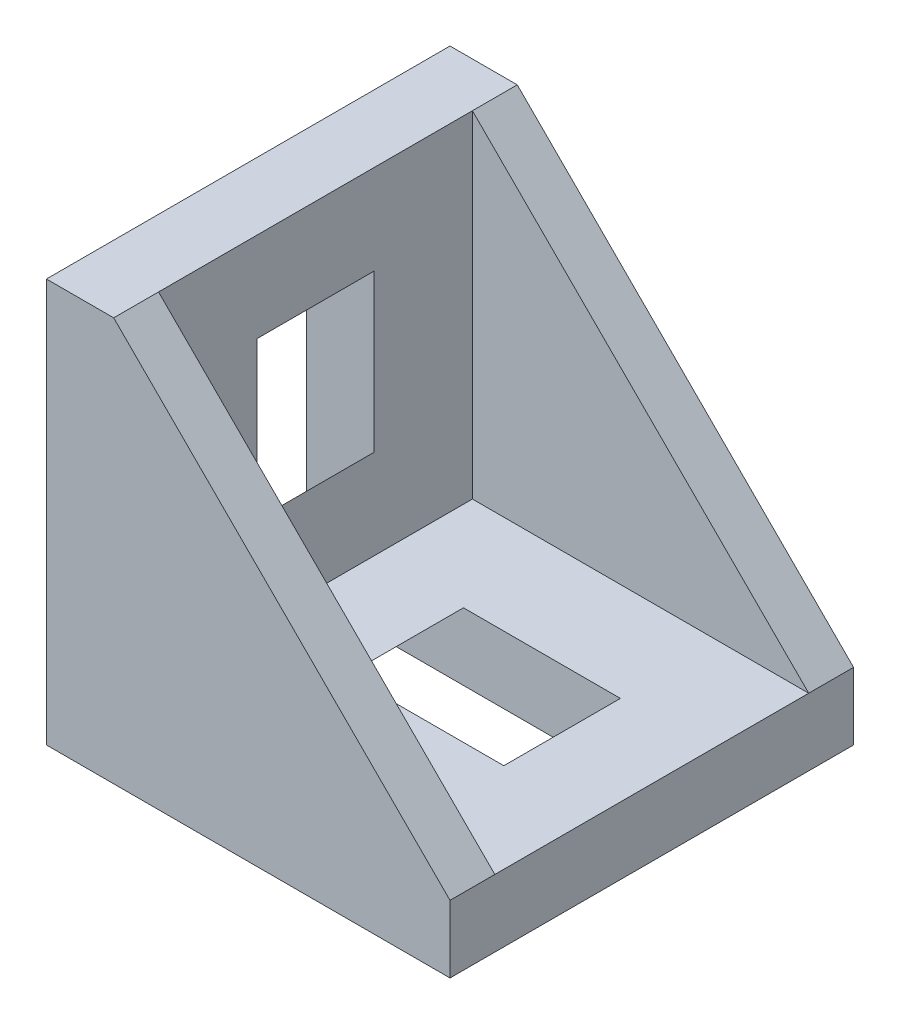
ISO-10303-21;
HEADER;
FILE_DESCRIPTION(('STEP AP214'),'2;1');
FILE_NAME('part.step','',(''),(''),'','','');
FILE_SCHEMA(('AUTOMOTIVE_DESIGN { 1 0 10303 214 1 1 1 1 }'));
ENDSEC;
DATA;
#1=APPLICATION_CONTEXT('core data for automotive mechanical design processes');
#2=APPLICATION_PROTOCOL_DEFINITION('international standard','automotive_design',2000,#1);
#3=PRODUCT_CONTEXT('',#1,'mechanical');
#4=PRODUCT('Part','Part','',(#3));
#5=PRODUCT_RELATED_PRODUCT_CATEGORY('part','',(#4));
#6=PRODUCT_DEFINITION_FORMATION('','',#4);
#7=PRODUCT_DEFINITION_CONTEXT('part definition',#1,'design');
#8=PRODUCT_DEFINITION('design','',#6,#7);
#9=PRODUCT_DEFINITION_SHAPE('','',#8);
#10=(LENGTH_UNIT() NAMED_UNIT(*) SI_UNIT(.MILLI.,.METRE.));
#11=(NAMED_UNIT(*) PLANE_ANGLE_UNIT() SI_UNIT($,.RADIAN.));
#12=(NAMED_UNIT(*) SI_UNIT($,.STERADIAN.) SOLID_ANGLE_UNIT());
#13=UNCERTAINTY_MEASURE_WITH_UNIT(LENGTH_MEASURE(1.E-05),#10,'distance_accuracy_value','');
#14=(GEOMETRIC_REPRESENTATION_CONTEXT(3) GLOBAL_UNCERTAINTY_ASSIGNED_CONTEXT((#13)) GLOBAL_UNIT_ASSIGNED_CONTEXT((#10,
#11,#12)) REPRESENTATION_CONTEXT('',''));
#15=CARTESIAN_POINT('',(0.,0.,0.));
#16=DIRECTION('',(0.,0.,1.));
#17=DIRECTION('',(1.,0.,0.));
#18=AXIS2_PLACEMENT_3D('',#15,#16,#17);
#19=CARTESIAN_POINT('',(0.,0.,9.));
#20=DIRECTION('',(1.,0.,0.));
#21=DIRECTION('',(0.,0.,-1.));
#22=AXIS2_PLACEMENT_3D('',#19,#20,#21);
#23=PLANE('',#22);
#24=DIRECTION('',(0.,0.,-1.));
#25=VECTOR('',#24,1.);
#26=CARTESIAN_POINT('',(0.,17.3,3.));
#27=LINE('',#26,#25);
#28=CARTESIAN_POINT('',(0.,17.3,3.));
#29=VERTEX_POINT('',#28);
#30=CARTESIAN_POINT('',(0.,17.3,-3.));
#31=VERTEX_POINT('',#30);
#32=EDGE_CURVE('E288',#29,#31,#27,.T.);
#33=ORIENTED_EDGE('',*,*,#32,.F.);
#34=DIRECTION('',(0.,1.,0.));
#35=VECTOR('',#34,1.);
#36=CARTESIAN_POINT('',(0.,17.3,3.));
#37=LINE('',#36,#35);
#38=CARTESIAN_POINT('',(0.,14.9992165715514,3.));
#39=VERTEX_POINT('',#38);
#40=EDGE_CURVE('E285',#39,#29,#37,.T.);
#41=ORIENTED_EDGE('',*,*,#40,.F.);
#42=DIRECTION('',(0.,0.,-1.));
#43=VECTOR('',#42,1.);
#44=CARTESIAN_POINT('',(0.,14.9992165715514,3.));
#45=LINE('',#44,#43);
#46=CARTESIAN_POINT('',(0.,14.9992165715514,-3.));
#47=VERTEX_POINT('',#46);
#48=EDGE_CURVE('E299',#39,#47,#45,.T.);
#49=ORIENTED_EDGE('',*,*,#48,.T.);
#50=DIRECTION('',(0.,1.,0.));
#51=VECTOR('',#50,1.);
#52=CARTESIAN_POINT('',(0.,17.3,-3.));
#53=LINE('',#52,#51);
#54=EDGE_CURVE('E280',#47,#31,#53,.T.);
#55=ORIENTED_EDGE('',*,*,#54,.T.);
#56=EDGE_LOOP('',(#33,#41,#49,#55));
#57=FACE_BOUND('',#56,.T.);
#58=DIRECTION('',(0.,-1.,0.));
#59=VECTOR('',#58,1.);
#60=CARTESIAN_POINT('',(0.,14.,-2.6));
#61=LINE('',#60,#59);
#62=CARTESIAN_POINT('',(0.,14.,-2.6));
#63=VERTEX_POINT('',#62);
#64=CARTESIAN_POINT('',(0.,4.,-2.6));
#65=VERTEX_POINT('',#64);
#66=EDGE_CURVE('E402',#63,#65,#61,.T.);
#67=ORIENTED_EDGE('',*,*,#66,.F.);
#68=DIRECTION('',(0.,0.,1.));
#69=VECTOR('',#68,1.);
#70=CARTESIAN_POINT('',(0.,14.,-2.6));
#71=LINE('',#70,#69);
#72=CARTESIAN_POINT('',(0.,14.,2.6));
#73=VERTEX_POINT('',#72);
#74=EDGE_CURVE('E425',#63,#73,#71,.T.);
#75=ORIENTED_EDGE('',*,*,#74,.T.);
#76=DIRECTION('',(0.,-1.,0.));
#77=VECTOR('',#76,1.);
#78=CARTESIAN_POINT('',(0.,14.,2.6));
#79=LINE('',#78,#77);
#80=CARTESIAN_POINT('',(0.,4.,2.6));
#81=VERTEX_POINT('',#80);
#82=EDGE_CURVE('E393',#73,#81,#79,.T.);
#83=ORIENTED_EDGE('',*,*,#82,.T.);
#84=DIRECTION('',(0.,0.,1.));
#85=VECTOR('',#84,1.);
#86=CARTESIAN_POINT('',(0.,4.,-2.6));
#87=LINE('',#86,#85);
#88=EDGE_CURVE('E414',#65,#81,#87,.T.);
#89=ORIENTED_EDGE('',*,*,#88,.F.);
#90=EDGE_LOOP('',(#67,#75,#83,#89));
#91=FACE_BOUND('',#90,.T.);
#92=DIRECTION('',(0.,-1.,0.));
#93=VECTOR('',#92,1.);
#94=CARTESIAN_POINT('',(0.,0.,-9.));
#95=LINE('',#94,#93);
#96=CARTESIAN_POINT('',(0.,18.,-9.));
#97=VERTEX_POINT('',#96);
#98=CARTESIAN_POINT('',(0.,0.,-9.));
#99=VERTEX_POINT('',#98);
#100=EDGE_CURVE('E465',#97,#99,#95,.T.);
#101=ORIENTED_EDGE('',*,*,#100,.T.);
#102=DIRECTION('',(0.,0.,-1.));
#103=VECTOR('',#102,1.);
#104=CARTESIAN_POINT('',(0.,0.,9.));
#105=LINE('',#104,#103);
#106=CARTESIAN_POINT('',(0.,0.,9.));
#107=VERTEX_POINT('',#106);
#108=EDGE_CURVE('E473',#107,#99,#105,.T.);
#109=ORIENTED_EDGE('',*,*,#108,.F.);
#110=DIRECTION('',(0.,-1.,0.));
#111=VECTOR('',#110,1.);
#112=CARTESIAN_POINT('',(0.,0.,9.));
#113=LINE('',#112,#111);
#114=CARTESIAN_POINT('',(0.,18.,9.));
#115=VERTEX_POINT('',#114);
#116=EDGE_CURVE('E471',#115,#107,#113,.T.);
#117=ORIENTED_EDGE('',*,*,#116,.F.);
#118=DIRECTION('',(0.,0.,-1.));
#119=VECTOR('',#118,1.);
#120=CARTESIAN_POINT('',(0.,18.,9.));
#121=LINE('',#120,#119);
#122=EDGE_CURVE('E487',#115,#97,#121,.T.);
#123=ORIENTED_EDGE('',*,*,#122,.T.);
#124=EDGE_LOOP('',(#101,#109,#117,#123));
#125=FACE_BOUND('',#124,.T.);
#126=DIRECTION('',(0.,1.,0.));
#127=VECTOR('',#126,1.);
#128=CARTESIAN_POINT('',(0.,1.23475047748415,3.));
#129=LINE('',#128,#127);
#130=CARTESIAN_POINT('',(0.,1.23475047748415,3.));
#131=VERTEX_POINT('',#130);
#132=CARTESIAN_POINT('',(0.,3.53553390593273,3.));
#133=VERTEX_POINT('',#132);
#134=EDGE_CURVE('E308',#131,#133,#129,.T.);
#135=ORIENTED_EDGE('',*,*,#134,.F.);
#136=DIRECTION('',(0.,0.,-1.));
#137=VECTOR('',#136,1.);
#138=CARTESIAN_POINT('',(0.,1.23475047748415,3.));
#139=LINE('',#138,#137);
#140=CARTESIAN_POINT('',(0.,1.23475047748415,-3.));
#141=VERTEX_POINT('',#140);
#142=EDGE_CURVE('E318',#131,#141,#139,.T.);
#143=ORIENTED_EDGE('',*,*,#142,.T.);
#144=DIRECTION('',(0.,1.,0.));
#145=VECTOR('',#144,1.);
#146=CARTESIAN_POINT('',(0.,1.23475047748415,-3.));
#147=LINE('',#146,#145);
#148=CARTESIAN_POINT('',(0.,3.53553390593273,-3.));
#149=VERTEX_POINT('',#148);
#150=EDGE_CURVE('E307',#141,#149,#147,.T.);
#151=ORIENTED_EDGE('',*,*,#150,.T.);
#152=DIRECTION('',(0.,0.,-1.));
#153=VECTOR('',#152,1.);
#154=CARTESIAN_POINT('',(0.,3.53553390593273,3.));
#155=LINE('',#154,#153);
#156=EDGE_CURVE('E334',#133,#149,#155,.T.);
#157=ORIENTED_EDGE('',*,*,#156,.F.);
#158=EDGE_LOOP('',(#135,#143,#151,#157));
#159=FACE_BOUND('',#158,.T.);
#160=ADVANCED_FACE('F32',(#57,#91,#125,#159),#23,.F.);
#161=CARTESIAN_POINT('',(18.,0.,9.));
#162=DIRECTION('',(0.,1.,0.));
#163=DIRECTION('',(-1.,0.,0.));
#164=AXIS2_PLACEMENT_3D('',#161,#162,#163);
#165=PLANE('',#164);
#166=DIRECTION('',(0.,0.,-1.));
#167=VECTOR('',#166,1.);
#168=CARTESIAN_POINT('',(14.9992165715514,0.,3.));
#169=LINE('',#168,#167);
#170=CARTESIAN_POINT('',(14.9992165715514,0.,3.));
#171=VERTEX_POINT('',#170);
#172=CARTESIAN_POINT('',(14.9992165715514,0.,-3.));
#173=VERTEX_POINT('',#172);
#174=EDGE_CURVE('E47',#171,#173,#169,.T.);
#175=ORIENTED_EDGE('',*,*,#174,.F.);
#176=DIRECTION('',(-1.,0.,0.));
#177=VECTOR('',#176,1.);
#178=CARTESIAN_POINT('',(17.3,0.,3.));
#179=LINE('',#178,#177);
#180=CARTESIAN_POINT('',(17.3,0.,3.));
#181=VERTEX_POINT('',#180);
#182=EDGE_CURVE('E52',#181,#171,#179,.T.);
#183=ORIENTED_EDGE('',*,*,#182,.F.);
#184=DIRECTION('',(0.,0.,-1.));
#185=VECTOR('',#184,1.);
#186=CARTESIAN_POINT('',(17.3,0.,3.));
#187=LINE('',#186,#185);
#188=CARTESIAN_POINT('',(17.3,0.,-3.));
#189=VERTEX_POINT('',#188);
#190=EDGE_CURVE('E260',#181,#189,#187,.T.);
#191=ORIENTED_EDGE('',*,*,#190,.T.);
#192=DIRECTION('',(-1.,0.,0.));
#193=VECTOR('',#192,1.);
#194=CARTESIAN_POINT('',(17.3,0.,-3.));
#195=LINE('',#194,#193);
#196=EDGE_CURVE('E264',#189,#173,#195,.T.);
#197=ORIENTED_EDGE('',*,*,#196,.T.);
#198=EDGE_LOOP('',(#175,#183,#191,#197));
#199=FACE_BOUND('',#198,.T.);
#200=DIRECTION('',(1.,0.,0.));
#201=VECTOR('',#200,1.);
#202=CARTESIAN_POINT('',(4.,0.,-2.6));
#203=LINE('',#202,#201);
#204=CARTESIAN_POINT('',(4.,0.,-2.6));
#205=VERTEX_POINT('',#204);
#206=CARTESIAN_POINT('',(14.,0.,-2.6));
#207=VERTEX_POINT('',#206);
#208=EDGE_CURVE('E370',#205,#207,#203,.T.);
#209=ORIENTED_EDGE('',*,*,#208,.F.);
#210=DIRECTION('',(0.,0.,1.));
#211=VECTOR('',#210,1.);
#212=CARTESIAN_POINT('',(4.,0.,-2.6));
#213=LINE('',#212,#211);
#214=CARTESIAN_POINT('',(4.,0.,2.6));
#215=VERTEX_POINT('',#214);
#216=EDGE_CURVE('E380',#205,#215,#213,.T.);
#217=ORIENTED_EDGE('',*,*,#216,.T.);
#218=DIRECTION('',(1.,0.,0.));
#219=VECTOR('',#218,1.);
#220=CARTESIAN_POINT('',(4.,0.,2.6));
#221=LINE('',#220,#219);
#222=CARTESIAN_POINT('',(14.,0.,2.6));
#223=VERTEX_POINT('',#222);
#224=EDGE_CURVE('E383',#215,#223,#221,.T.);
#225=ORIENTED_EDGE('',*,*,#224,.T.);
#226=DIRECTION('',(0.,0.,1.));
#227=VECTOR('',#226,1.);
#228=CARTESIAN_POINT('',(14.,0.,-2.6));
#229=LINE('',#228,#227);
#230=EDGE_CURVE('E397',#207,#223,#229,.T.);
#231=ORIENTED_EDGE('',*,*,#230,.F.);
#232=EDGE_LOOP('',(#209,#217,#225,#231));
#233=FACE_BOUND('',#232,.T.);
#234=DIRECTION('',(1.,0.,0.));
#235=VECTOR('',#234,1.);
#236=CARTESIAN_POINT('',(18.,0.,-9.));
#237=LINE('',#236,#235);
#238=CARTESIAN_POINT('',(18.,0.,-9.));
#239=VERTEX_POINT('',#238);
#240=EDGE_CURVE('E457',#99,#239,#237,.T.);
#241=ORIENTED_EDGE('',*,*,#240,.T.);
#242=DIRECTION('',(0.,0.,-1.));
#243=VECTOR('',#242,1.);
#244=CARTESIAN_POINT('',(18.,0.,9.));
#245=LINE('',#244,#243);
#246=CARTESIAN_POINT('',(18.,0.,9.));
#247=VERTEX_POINT('',#246);
#248=EDGE_CURVE('E11',#247,#239,#245,.T.);
#249=ORIENTED_EDGE('',*,*,#248,.F.);
#250=DIRECTION('',(1.,0.,0.));
#251=VECTOR('',#250,1.);
#252=CARTESIAN_POINT('',(18.,0.,9.));
#253=LINE('',#252,#251);
#254=EDGE_CURVE('E461',#107,#247,#253,.T.);
#255=ORIENTED_EDGE('',*,*,#254,.F.);
#256=ORIENTED_EDGE('',*,*,#108,.T.);
#257=EDGE_LOOP('',(#241,#249,#255,#256));
#258=FACE_BOUND('',#257,.T.);
#259=DIRECTION('',(-1.,0.,0.));
#260=VECTOR('',#259,1.);
#261=CARTESIAN_POINT('',(1.23475047748409,0.,3.));
#262=LINE('',#261,#260);
#263=CARTESIAN_POINT('',(3.53553390593274,0.,3.));
#264=VERTEX_POINT('',#263);
#265=CARTESIAN_POINT('',(1.23475047748409,0.,3.));
#266=VERTEX_POINT('',#265);
#267=EDGE_CURVE('E339',#264,#266,#262,.T.);
#268=ORIENTED_EDGE('',*,*,#267,.F.);
#269=DIRECTION('',(0.,0.,-1.));
#270=VECTOR('',#269,1.);
#271=CARTESIAN_POINT('',(3.53553390593274,0.,3.));
#272=LINE('',#271,#270);
#273=CARTESIAN_POINT('',(3.53553390593274,0.,-3.));
#274=VERTEX_POINT('',#273);
#275=EDGE_CURVE('E363',#264,#274,#272,.T.);
#276=ORIENTED_EDGE('',*,*,#275,.T.);
#277=DIRECTION('',(-1.,0.,0.));
#278=VECTOR('',#277,1.);
#279=CARTESIAN_POINT('',(1.23475047748409,0.,-3.));
#280=LINE('',#279,#278);
#281=CARTESIAN_POINT('',(1.23475047748409,0.,-3.));
#282=VERTEX_POINT('',#281);
#283=EDGE_CURVE('E349',#274,#282,#280,.T.);
#284=ORIENTED_EDGE('',*,*,#283,.T.);
#285=DIRECTION('',(0.,0.,-1.));
#286=VECTOR('',#285,1.);
#287=CARTESIAN_POINT('',(1.23475047748409,0.,3.));
#288=LINE('',#287,#286);
#289=EDGE_CURVE('E360',#266,#282,#288,.T.);
#290=ORIENTED_EDGE('',*,*,#289,.F.);
#291=EDGE_LOOP('',(#268,#276,#284,#290));
#292=FACE_BOUND('',#291,.T.);
#293=ADVANCED_FACE('F34',(#199,#233,#258,#292),#165,.F.);
#294=CARTESIAN_POINT('',(3.,3.,-7.));
#295=DIRECTION('',(0.,-1.,0.));
#296=DIRECTION('',(0.,0.,-1.));
#297=AXIS2_PLACEMENT_3D('',#294,#295,#296);
#298=PLANE('',#297);
#299=DIRECTION('',(1.,0.,0.));
#300=VECTOR('',#299,1.);
#301=CARTESIAN_POINT('',(3.,3.,7.));
#302=LINE('',#301,#300);
#303=CARTESIAN_POINT('',(3.,3.,7.));
#304=VERTEX_POINT('',#303);
#305=CARTESIAN_POINT('',(18.,3.,7.));
#306=VERTEX_POINT('',#305);
#307=EDGE_CURVE('E440',#304,#306,#302,.T.);
#308=ORIENTED_EDGE('',*,*,#307,.T.);
#309=DIRECTION('',(0.,0.,1.));
#310=VECTOR('',#309,1.);
#311=CARTESIAN_POINT('',(18.,3.,-7.));
#312=LINE('',#311,#310);
#313=CARTESIAN_POINT('',(18.,3.,-7.));
#314=VERTEX_POINT('',#313);
#315=EDGE_CURVE('E454',#314,#306,#312,.T.);
#316=ORIENTED_EDGE('',*,*,#315,.F.);
#317=DIRECTION('',(1.,0.,0.));
#318=VECTOR('',#317,1.);
#319=CARTESIAN_POINT('',(3.,3.,-7.));
#320=LINE('',#319,#318);
#321=CARTESIAN_POINT('',(3.,3.,-7.));
#322=VERTEX_POINT('',#321);
#323=EDGE_CURVE('E443',#322,#314,#320,.T.);
#324=ORIENTED_EDGE('',*,*,#323,.F.);
#325=DIRECTION('',(0.,0.,1.));
#326=VECTOR('',#325,1.);
#327=CARTESIAN_POINT('',(3.,3.,-7.));
#328=LINE('',#327,#326);
#329=EDGE_CURVE('E458',#322,#304,#328,.T.);
#330=ORIENTED_EDGE('',*,*,#329,.T.);
#331=EDGE_LOOP('',(#308,#316,#324,#330));
#332=FACE_BOUND('',#331,.T.);
#333=DIRECTION('',(-1.,0.,0.));
#334=VECTOR('',#333,1.);
#335=CARTESIAN_POINT('',(7.,3.,-2.6));
#336=LINE('',#335,#334);
#337=CARTESIAN_POINT('',(14.,3.,-2.6));
#338=VERTEX_POINT('',#337);
#339=CARTESIAN_POINT('',(7.,3.,-2.6));
#340=VERTEX_POINT('',#339);
#341=EDGE_CURVE('E377',#338,#340,#336,.T.);
#342=ORIENTED_EDGE('',*,*,#341,.F.);
#343=DIRECTION('',(0.,0.,1.));
#344=VECTOR('',#343,1.);
#345=CARTESIAN_POINT('',(14.,3.,-2.6));
#346=LINE('',#345,#344);
#347=CARTESIAN_POINT('',(14.,3.,2.6));
#348=VERTEX_POINT('',#347);
#349=EDGE_CURVE('E394',#338,#348,#346,.T.);
#350=ORIENTED_EDGE('',*,*,#349,.T.);
#351=DIRECTION('',(-1.,0.,0.));
#352=VECTOR('',#351,1.);
#353=CARTESIAN_POINT('',(7.,3.,2.6));
#354=LINE('',#353,#352);
#355=CARTESIAN_POINT('',(7.,3.,2.6));
#356=VERTEX_POINT('',#355);
#357=EDGE_CURVE('E371',#348,#356,#354,.T.);
#358=ORIENTED_EDGE('',*,*,#357,.T.);
#359=DIRECTION('',(0.,0.,1.));
#360=VECTOR('',#359,1.);
#361=CARTESIAN_POINT('',(7.,3.,-2.6));
#362=LINE('',#361,#360);
#363=EDGE_CURVE('E390',#340,#356,#362,.T.);
#364=ORIENTED_EDGE('',*,*,#363,.F.);
#365=EDGE_LOOP('',(#342,#350,#358,#364));
#366=FACE_BOUND('',#365,.T.);
#367=ADVANCED_FACE('F531',(#332,#366),#298,.F.);
#368=CARTESIAN_POINT('',(3.,18.,-7.));
#369=DIRECTION('',(-1.,0.,0.));
#370=DIRECTION('',(0.,-1.,0.));
#371=AXIS2_PLACEMENT_3D('',#368,#369,#370);
#372=PLANE('',#371);
#373=DIRECTION('',(0.,-1.,0.));
#374=VECTOR('',#373,1.);
#375=CARTESIAN_POINT('',(3.,18.,7.));
#376=LINE('',#375,#374);
#377=CARTESIAN_POINT('',(3.,18.,7.));
#378=VERTEX_POINT('',#377);
#379=EDGE_CURVE('E449',#378,#304,#376,.T.);
#380=ORIENTED_EDGE('',*,*,#379,.T.);
#381=ORIENTED_EDGE('',*,*,#329,.F.);
#382=DIRECTION('',(0.,-1.,0.));
#383=VECTOR('',#382,1.);
#384=CARTESIAN_POINT('',(3.,18.,-7.));
#385=LINE('',#384,#383);
#386=CARTESIAN_POINT('',(3.,18.,-7.));
#387=VERTEX_POINT('',#386);
#388=EDGE_CURVE('E439',#387,#322,#385,.T.);
#389=ORIENTED_EDGE('',*,*,#388,.F.);
#390=DIRECTION('',(0.,0.,1.));
#391=VECTOR('',#390,1.);
#392=CARTESIAN_POINT('',(3.,18.,-7.));
#393=LINE('',#392,#391);
#394=EDGE_CURVE('E446',#387,#378,#393,.T.);
#395=ORIENTED_EDGE('',*,*,#394,.T.);
#396=EDGE_LOOP('',(#380,#381,#389,#395));
#397=FACE_BOUND('',#396,.T.);
#398=DIRECTION('',(0.,1.,0.));
#399=VECTOR('',#398,1.);
#400=CARTESIAN_POINT('',(3.,14.,-2.6));
#401=LINE('',#400,#399);
#402=CARTESIAN_POINT('',(3.,7.,-2.6));
#403=VERTEX_POINT('',#402);
#404=CARTESIAN_POINT('',(3.,14.,-2.6));
#405=VERTEX_POINT('',#404);
#406=EDGE_CURVE('E409',#403,#405,#401,.T.);
#407=ORIENTED_EDGE('',*,*,#406,.F.);
#408=DIRECTION('',(0.,0.,1.));
#409=VECTOR('',#408,1.);
#410=CARTESIAN_POINT('',(3.,7.,-2.6));
#411=LINE('',#410,#409);
#412=CARTESIAN_POINT('',(3.,7.,2.6));
#413=VERTEX_POINT('',#412);
#414=EDGE_CURVE('E432',#403,#413,#411,.T.);
#415=ORIENTED_EDGE('',*,*,#414,.T.);
#416=DIRECTION('',(0.,1.,0.));
#417=VECTOR('',#416,1.);
#418=CARTESIAN_POINT('',(3.,14.,2.6));
#419=LINE('',#418,#417);
#420=CARTESIAN_POINT('',(3.,14.,2.6));
#421=VERTEX_POINT('',#420);
#422=EDGE_CURVE('E420',#413,#421,#419,.T.);
#423=ORIENTED_EDGE('',*,*,#422,.T.);
#424=DIRECTION('',(0.,0.,1.));
#425=VECTOR('',#424,1.);
#426=CARTESIAN_POINT('',(3.,14.,-2.6));
#427=LINE('',#426,#425);
#428=EDGE_CURVE('E429',#405,#421,#427,.T.);
#429=ORIENTED_EDGE('',*,*,#428,.F.);
#430=EDGE_LOOP('',(#407,#415,#423,#429));
#431=FACE_BOUND('',#430,.T.);
#432=ADVANCED_FACE('F536',(#397,#431),#372,.F.);
#433=CARTESIAN_POINT('',(18.,3.,9.));
#434=DIRECTION('',(-0.707106781186547,-0.707106781186547,0.));
#435=DIRECTION('',(0.707106781186548,-0.707106781186548,0.));
#436=AXIS2_PLACEMENT_3D('',#433,#434,#435);
#437=PLANE('',#436);
#438=DIRECTION('',(-0.707106781186547,0.707106781186547,0.));
#439=VECTOR('',#438,1.);
#440=CARTESIAN_POINT('',(3.,18.,-7.));
#441=LINE('',#440,#439);
#442=EDGE_CURVE('E437',#314,#387,#441,.T.);
#443=ORIENTED_EDGE('',*,*,#442,.F.);
#444=DIRECTION('',(0.,0.,-1.));
#445=VECTOR('',#444,1.);
#446=CARTESIAN_POINT('',(18.,3.,9.));
#447=LINE('',#446,#445);
#448=CARTESIAN_POINT('',(18.,3.,-9.));
#449=VERTEX_POINT('',#448);
#450=EDGE_CURVE('E493',#314,#449,#447,.T.);
#451=ORIENTED_EDGE('',*,*,#450,.T.);
#452=DIRECTION('',(-0.707106781186547,0.707106781186547,0.));
#453=VECTOR('',#452,1.);
#454=CARTESIAN_POINT('',(18.,3.,-9.));
#455=LINE('',#454,#453);
#456=CARTESIAN_POINT('',(3.,18.,-9.));
#457=VERTEX_POINT('',#456);
#458=EDGE_CURVE('E479',#449,#457,#455,.T.);
#459=ORIENTED_EDGE('',*,*,#458,.T.);
#460=DIRECTION('',(0.,0.,-1.));
#461=VECTOR('',#460,1.);
#462=CARTESIAN_POINT('',(3.,18.,9.));
#463=LINE('',#462,#461);
#464=EDGE_CURVE('E490',#387,#457,#463,.T.);
#465=ORIENTED_EDGE('',*,*,#464,.F.);
#466=EDGE_LOOP('',(#443,#451,#459,#465));
#467=FACE_BOUND('',#466,.T.);
#468=ADVANCED_FACE('F501',(#467),#437,.F.);
#469=CARTESIAN_POINT('',(18.,3.,9.));
#470=DIRECTION('',(-1.,0.,0.));
#471=DIRECTION('',(0.,0.,1.));
#472=AXIS2_PLACEMENT_3D('',#469,#470,#471);
#473=PLANE('',#472);
#474=DIRECTION('',(0.,1.,0.));
#475=VECTOR('',#474,1.);
#476=CARTESIAN_POINT('',(18.,3.,-9.));
#477=LINE('',#476,#475);
#478=EDGE_CURVE('E476',#239,#449,#477,.T.);
#479=ORIENTED_EDGE('',*,*,#478,.T.);
#480=ORIENTED_EDGE('',*,*,#450,.F.);
#481=ORIENTED_EDGE('',*,*,#315,.T.);
#482=CARTESIAN_POINT('',(18.,3.,9.));
#483=VERTEX_POINT('',#482);
#484=EDGE_CURVE('E40',#483,#306,#447,.T.);
#485=ORIENTED_EDGE('',*,*,#484,.F.);
#486=DIRECTION('',(0.,1.,0.));
#487=VECTOR('',#486,1.);
#488=CARTESIAN_POINT('',(18.,3.,9.));
#489=LINE('',#488,#487);
#490=EDGE_CURVE('E464',#247,#483,#489,.T.);
#491=ORIENTED_EDGE('',*,*,#490,.F.);
#492=ORIENTED_EDGE('',*,*,#248,.T.);
#493=EDGE_LOOP('',(#479,#480,#481,#485,#491,#492));
#494=FACE_BOUND('',#493,.T.);
#495=ADVANCED_FACE('F506',(#494),#473,.F.);
#496=ORIENTED_EDGE('',*,*,#484,.T.);
#497=DIRECTION('',(-0.707106781186547,0.707106781186547,0.));
#498=VECTOR('',#497,1.);
#499=CARTESIAN_POINT('',(3.,18.,7.));
#500=LINE('',#499,#498);
#501=EDGE_CURVE('E428',#306,#378,#500,.T.);
#502=ORIENTED_EDGE('',*,*,#501,.T.);
#503=CARTESIAN_POINT('',(3.,18.,9.));
#504=VERTEX_POINT('',#503);
#505=EDGE_CURVE('E491',#504,#378,#463,.T.);
#506=ORIENTED_EDGE('',*,*,#505,.F.);
#507=DIRECTION('',(-0.707106781186547,0.707106781186547,0.));
#508=VECTOR('',#507,1.);
#509=CARTESIAN_POINT('',(18.,3.,9.));
#510=LINE('',#509,#508);
#511=EDGE_CURVE('E467',#483,#504,#510,.T.);
#512=ORIENTED_EDGE('',*,*,#511,.F.);
#513=EDGE_LOOP('',(#496,#502,#506,#512));
#514=FACE_BOUND('',#513,.T.);
#515=ADVANCED_FACE('F525',(#514),#437,.F.);
#516=CARTESIAN_POINT('',(3.,18.,9.));
#517=DIRECTION('',(0.,-1.,0.));
#518=DIRECTION('',(0.,0.,-1.));
#519=AXIS2_PLACEMENT_3D('',#516,#517,#518);
#520=PLANE('',#519);
#521=DIRECTION('',(-1.,0.,0.));
#522=VECTOR('',#521,1.);
#523=CARTESIAN_POINT('',(3.,18.,-9.));
#524=LINE('',#523,#522);
#525=EDGE_CURVE('E482',#457,#97,#524,.T.);
#526=ORIENTED_EDGE('',*,*,#525,.T.);
#527=ORIENTED_EDGE('',*,*,#122,.F.);
#528=DIRECTION('',(-1.,0.,0.));
#529=VECTOR('',#528,1.);
#530=CARTESIAN_POINT('',(3.,18.,9.));
#531=LINE('',#530,#529);
#532=EDGE_CURVE('E469',#504,#115,#531,.T.);
#533=ORIENTED_EDGE('',*,*,#532,.F.);
#534=ORIENTED_EDGE('',*,*,#505,.T.);
#535=ORIENTED_EDGE('',*,*,#394,.F.);
#536=ORIENTED_EDGE('',*,*,#464,.T.);
#537=EDGE_LOOP('',(#526,#527,#533,#534,#535,#536));
#538=FACE_BOUND('',#537,.T.);
#539=ADVANCED_FACE('F514',(#538),#520,.F.);
#540=CARTESIAN_POINT('',(0.,0.,9.));
#541=DIRECTION('',(0.,0.,-1.));
#542=DIRECTION('',(-1.,0.,0.));
#543=AXIS2_PLACEMENT_3D('',#540,#541,#542);
#544=PLANE('',#543);
#545=ORIENTED_EDGE('',*,*,#254,.T.);
#546=ORIENTED_EDGE('',*,*,#490,.T.);
#547=ORIENTED_EDGE('',*,*,#511,.T.);
#548=ORIENTED_EDGE('',*,*,#532,.T.);
#549=ORIENTED_EDGE('',*,*,#116,.T.);
#550=EDGE_LOOP('',(#545,#546,#547,#548,#549));
#551=FACE_BOUND('',#550,.T.);
#552=ADVANCED_FACE('F523',(#551),#544,.F.);
#553=CARTESIAN_POINT('',(0.,0.,-9.));
#554=DIRECTION('',(0.,0.,-1.));
#555=DIRECTION('',(-1.,0.,0.));
#556=AXIS2_PLACEMENT_3D('',#553,#554,#555);
#557=PLANE('',#556);
#558=ORIENTED_EDGE('',*,*,#240,.F.);
#559=ORIENTED_EDGE('',*,*,#100,.F.);
#560=ORIENTED_EDGE('',*,*,#525,.F.);
#561=ORIENTED_EDGE('',*,*,#458,.F.);
#562=ORIENTED_EDGE('',*,*,#478,.F.);
#563=EDGE_LOOP('',(#558,#559,#560,#561,#562));
#564=FACE_BOUND('',#563,.T.);
#565=ADVANCED_FACE('F510',(#564),#557,.T.);
#566=CARTESIAN_POINT('',(18.,3.,-7.));
#567=DIRECTION('',(0.,0.,1.));
#568=DIRECTION('',(1.,0.,0.));
#569=AXIS2_PLACEMENT_3D('',#566,#567,#568);
#570=PLANE('',#569);
#571=ORIENTED_EDGE('',*,*,#442,.T.);
#572=ORIENTED_EDGE('',*,*,#388,.T.);
#573=ORIENTED_EDGE('',*,*,#323,.T.);
#574=EDGE_LOOP('',(#571,#572,#573));
#575=FACE_BOUND('',#574,.T.);
#576=ADVANCED_FACE('F539',(#575),#570,.T.);
#577=CARTESIAN_POINT('',(18.,3.,7.));
#578=DIRECTION('',(0.,0.,1.));
#579=DIRECTION('',(1.,0.,0.));
#580=AXIS2_PLACEMENT_3D('',#577,#578,#579);
#581=PLANE('',#580);
#582=ORIENTED_EDGE('',*,*,#501,.F.);
#583=ORIENTED_EDGE('',*,*,#307,.F.);
#584=ORIENTED_EDGE('',*,*,#379,.F.);
#585=EDGE_LOOP('',(#582,#583,#584));
#586=FACE_BOUND('',#585,.T.);
#587=ADVANCED_FACE('F529',(#586),#581,.F.);
#588=CARTESIAN_POINT('',(0.,14.,-2.6));
#589=DIRECTION('',(0.,1.,0.));
#590=DIRECTION('',(0.,0.,1.));
#591=AXIS2_PLACEMENT_3D('',#588,#589,#590);
#592=PLANE('',#591);
#593=DIRECTION('',(-1.,0.,0.));
#594=VECTOR('',#593,1.);
#595=CARTESIAN_POINT('',(0.,14.,2.6));
#596=LINE('',#595,#594);
#597=EDGE_CURVE('E406',#421,#73,#596,.T.);
#598=ORIENTED_EDGE('',*,*,#597,.T.);
#599=ORIENTED_EDGE('',*,*,#74,.F.);
#600=DIRECTION('',(-1.,0.,0.));
#601=VECTOR('',#600,1.);
#602=CARTESIAN_POINT('',(0.,14.,-2.6));
#603=LINE('',#602,#601);
#604=EDGE_CURVE('E411',#405,#63,#603,.T.);
#605=ORIENTED_EDGE('',*,*,#604,.F.);
#606=ORIENTED_EDGE('',*,*,#428,.T.);
#607=EDGE_LOOP('',(#598,#599,#605,#606));
#608=FACE_BOUND('',#607,.T.);
#609=ADVANCED_FACE('F546',(#608),#592,.F.);
#610=CARTESIAN_POINT('',(0.,4.,-2.6));
#611=DIRECTION('',(0.707106781186548,-0.707106781186547,0.));
#612=DIRECTION('',(0.707106781186547,0.707106781186548,0.));
#613=AXIS2_PLACEMENT_3D('',#610,#611,#612);
#614=PLANE('',#613);
#615=DIRECTION('',(0.707106781186547,0.707106781186548,0.));
#616=VECTOR('',#615,1.);
#617=CARTESIAN_POINT('',(0.,4.,2.6));
#618=LINE('',#617,#616);
#619=EDGE_CURVE('E417',#81,#413,#618,.T.);
#620=ORIENTED_EDGE('',*,*,#619,.T.);
#621=ORIENTED_EDGE('',*,*,#414,.F.);
#622=DIRECTION('',(0.707106781186547,0.707106781186548,0.));
#623=VECTOR('',#622,1.);
#624=CARTESIAN_POINT('',(0.,4.,-2.6));
#625=LINE('',#624,#623);
#626=EDGE_CURVE('E405',#65,#403,#625,.T.);
#627=ORIENTED_EDGE('',*,*,#626,.F.);
#628=ORIENTED_EDGE('',*,*,#88,.T.);
#629=EDGE_LOOP('',(#620,#621,#627,#628));
#630=FACE_BOUND('',#629,.T.);
#631=ADVANCED_FACE('F630',(#630),#614,.F.);
#632=CARTESIAN_POINT('',(0.,14.,-2.6));
#633=DIRECTION('',(0.,0.,1.));
#634=DIRECTION('',(1.,0.,0.));
#635=AXIS2_PLACEMENT_3D('',#632,#633,#634);
#636=PLANE('',#635);
#637=ORIENTED_EDGE('',*,*,#66,.T.);
#638=ORIENTED_EDGE('',*,*,#626,.T.);
#639=ORIENTED_EDGE('',*,*,#406,.T.);
#640=ORIENTED_EDGE('',*,*,#604,.T.);
#641=EDGE_LOOP('',(#637,#638,#639,#640));
#642=FACE_BOUND('',#641,.T.);
#643=ADVANCED_FACE('F640',(#642),#636,.T.);
#644=CARTESIAN_POINT('',(0.,14.,2.6));
#645=DIRECTION('',(0.,0.,1.));
#646=DIRECTION('',(1.,0.,0.));
#647=AXIS2_PLACEMENT_3D('',#644,#645,#646);
#648=PLANE('',#647);
#649=ORIENTED_EDGE('',*,*,#82,.F.);
#650=ORIENTED_EDGE('',*,*,#597,.F.);
#651=ORIENTED_EDGE('',*,*,#422,.F.);
#652=ORIENTED_EDGE('',*,*,#619,.F.);
#653=EDGE_LOOP('',(#649,#650,#651,#652));
#654=FACE_BOUND('',#653,.T.);
#655=ADVANCED_FACE('F649',(#654),#648,.F.);
#656=CARTESIAN_POINT('',(7.,3.,-2.6));
#657=DIRECTION('',(-0.707106781186548,0.707106781186547,0.));
#658=DIRECTION('',(-0.707106781186547,-0.707106781186548,0.));
#659=AXIS2_PLACEMENT_3D('',#656,#657,#658);
#660=PLANE('',#659);
#661=DIRECTION('',(-0.707106781186547,-0.707106781186548,0.));
#662=VECTOR('',#661,1.);
#663=CARTESIAN_POINT('',(7.,3.,2.6));
#664=LINE('',#663,#662);
#665=EDGE_CURVE('E366',#356,#215,#664,.T.);
#666=ORIENTED_EDGE('',*,*,#665,.T.);
#667=ORIENTED_EDGE('',*,*,#216,.F.);
#668=DIRECTION('',(-0.707106781186547,-0.707106781186548,0.));
#669=VECTOR('',#668,1.);
#670=CARTESIAN_POINT('',(7.,3.,-2.6));
#671=LINE('',#670,#669);
#672=EDGE_CURVE('E367',#340,#205,#671,.T.);
#673=ORIENTED_EDGE('',*,*,#672,.F.);
#674=ORIENTED_EDGE('',*,*,#363,.T.);
#675=EDGE_LOOP('',(#666,#667,#673,#674));
#676=FACE_BOUND('',#675,.T.);
#677=ADVANCED_FACE('F659',(#676),#660,.F.);
#678=CARTESIAN_POINT('',(14.,3.,-2.6));
#679=DIRECTION('',(1.,0.,0.));
#680=DIRECTION('',(0.,0.,-1.));
#681=AXIS2_PLACEMENT_3D('',#678,#679,#680);
#682=PLANE('',#681);
#683=DIRECTION('',(0.,1.,0.));
#684=VECTOR('',#683,1.);
#685=CARTESIAN_POINT('',(14.,3.,2.6));
#686=LINE('',#685,#684);
#687=EDGE_CURVE('E386',#223,#348,#686,.T.);
#688=ORIENTED_EDGE('',*,*,#687,.T.);
#689=ORIENTED_EDGE('',*,*,#349,.F.);
#690=DIRECTION('',(0.,1.,0.));
#691=VECTOR('',#690,1.);
#692=CARTESIAN_POINT('',(14.,3.,-2.6));
#693=LINE('',#692,#691);
#694=EDGE_CURVE('E374',#207,#338,#693,.T.);
#695=ORIENTED_EDGE('',*,*,#694,.F.);
#696=ORIENTED_EDGE('',*,*,#230,.T.);
#697=EDGE_LOOP('',(#688,#689,#695,#696));
#698=FACE_BOUND('',#697,.T.);
#699=ADVANCED_FACE('F669',(#698),#682,.F.);
#700=CARTESIAN_POINT('',(4.,0.,-2.6));
#701=DIRECTION('',(0.,0.,1.));
#702=DIRECTION('',(1.,0.,0.));
#703=AXIS2_PLACEMENT_3D('',#700,#701,#702);
#704=PLANE('',#703);
#705=ORIENTED_EDGE('',*,*,#672,.T.);
#706=ORIENTED_EDGE('',*,*,#208,.T.);
#707=ORIENTED_EDGE('',*,*,#694,.T.);
#708=ORIENTED_EDGE('',*,*,#341,.T.);
#709=EDGE_LOOP('',(#705,#706,#707,#708));
#710=FACE_BOUND('',#709,.T.);
#711=ADVANCED_FACE('F679',(#710),#704,.T.);
#712=CARTESIAN_POINT('',(4.,0.,2.6));
#713=DIRECTION('',(0.,0.,1.));
#714=DIRECTION('',(1.,0.,0.));
#715=AXIS2_PLACEMENT_3D('',#712,#713,#714);
#716=PLANE('',#715);
#717=ORIENTED_EDGE('',*,*,#665,.F.);
#718=ORIENTED_EDGE('',*,*,#357,.F.);
#719=ORIENTED_EDGE('',*,*,#687,.F.);
#720=ORIENTED_EDGE('',*,*,#224,.F.);
#721=EDGE_LOOP('',(#717,#718,#719,#720));
#722=FACE_BOUND('',#721,.T.);
#723=ADVANCED_FACE('F689',(#722),#716,.F.);
#724=CARTESIAN_POINT('',(3.53553390593274,0.,3.));
#725=DIRECTION('',(-0.663272861612094,0.748377652692077,0.));
#726=DIRECTION('',(-0.748377652692077,-0.663272861612095,0.));
#727=AXIS2_PLACEMENT_3D('',#724,#725,#726);
#728=PLANE('',#727);
#729=DIRECTION('',(0.748377652692077,0.663272861612094,0.));
#730=VECTOR('',#729,1.);
#731=CARTESIAN_POINT('',(3.53553390593274,0.,-3.));
#732=LINE('',#731,#730);
#733=CARTESIAN_POINT('',(1.49748336761072,-1.80628537984834,-3.));
#734=VERTEX_POINT('',#733);
#735=EDGE_CURVE('E336',#734,#274,#732,.T.);
#736=ORIENTED_EDGE('',*,*,#735,.T.);
#737=ORIENTED_EDGE('',*,*,#275,.F.);
#738=DIRECTION('',(0.748377652692077,0.663272861612094,0.));
#739=VECTOR('',#738,1.);
#740=CARTESIAN_POINT('',(3.53553390593274,0.,3.));
#741=LINE('',#740,#739);
#742=CARTESIAN_POINT('',(1.49748336761072,-1.80628537984834,3.));
#743=VERTEX_POINT('',#742);
#744=EDGE_CURVE('E337',#743,#264,#741,.T.);
#745=ORIENTED_EDGE('',*,*,#744,.F.);
#746=DIRECTION('',(0.,0.,-1.));
#747=VECTOR('',#746,1.);
#748=CARTESIAN_POINT('',(1.49748336761072,-1.80628537984834,3.));
#749=LINE('',#748,#747);
#750=EDGE_CURVE('E346',#743,#734,#749,.T.);
#751=ORIENTED_EDGE('',*,*,#750,.T.);
#752=EDGE_LOOP('',(#736,#737,#745,#751));
#753=FACE_BOUND('',#752,.T.);
#754=ADVANCED_FACE('F698',(#753),#728,.F.);
#755=CARTESIAN_POINT('',(0.504853676887192,-0.797938337342914,3.));
#756=DIRECTION('',(0.73786614945659,-0.674947068655094,0.));
#757=DIRECTION('',(0.674947068655094,0.73786614945659,0.));
#758=AXIS2_PLACEMENT_3D('',#755,#756,#757);
#759=PLANE('',#758);
#760=DIRECTION('',(-0.674947068655094,-0.737866149456591,0.));
#761=VECTOR('',#760,1.);
#762=CARTESIAN_POINT('',(0.504853676887192,-0.797938337342914,-3.));
#763=LINE('',#762,#761);
#764=CARTESIAN_POINT('',(0.504853676887192,-0.797938337342914,-3.));
#765=VERTEX_POINT('',#764);
#766=EDGE_CURVE('E352',#282,#765,#763,.T.);
#767=ORIENTED_EDGE('',*,*,#766,.T.);
#768=DIRECTION('',(0.,0.,-1.));
#769=VECTOR('',#768,1.);
#770=CARTESIAN_POINT('',(0.504853676887192,-0.797938337342914,3.));
#771=LINE('',#770,#769);
#772=CARTESIAN_POINT('',(0.504853676887192,-0.797938337342914,3.));
#773=VERTEX_POINT('',#772);
#774=EDGE_CURVE('E357',#773,#765,#771,.T.);
#775=ORIENTED_EDGE('',*,*,#774,.F.);
#776=DIRECTION('',(-0.674947068655094,-0.737866149456591,0.));
#777=VECTOR('',#776,1.);
#778=CARTESIAN_POINT('',(0.504853676887192,-0.797938337342914,3.));
#779=LINE('',#778,#777);
#780=EDGE_CURVE('E342',#266,#773,#779,.T.);
#781=ORIENTED_EDGE('',*,*,#780,.F.);
#782=ORIENTED_EDGE('',*,*,#289,.T.);
#783=EDGE_LOOP('',(#767,#775,#781,#782));
#784=FACE_BOUND('',#783,.T.);
#785=ADVANCED_FACE('F719',(#784),#759,.F.);
#786=CARTESIAN_POINT('',(1.49748336761072,-1.80628537984834,3.));
#787=DIRECTION('',(0.712639007666149,0.701530929291508,0.));
#788=DIRECTION('',(-0.701530929291508,0.712639007666149,0.));
#789=AXIS2_PLACEMENT_3D('',#786,#787,#788);
#790=PLANE('',#789);
#791=DIRECTION('',(0.701530929291508,-0.712639007666149,0.));
#792=VECTOR('',#791,1.);
#793=CARTESIAN_POINT('',(1.49748336761072,-1.80628537984834,-3.));
#794=LINE('',#793,#792);
#795=EDGE_CURVE('E340',#765,#734,#794,.T.);
#796=ORIENTED_EDGE('',*,*,#795,.T.);
#797=ORIENTED_EDGE('',*,*,#750,.F.);
#798=DIRECTION('',(0.701530929291508,-0.712639007666149,0.));
#799=VECTOR('',#798,1.);
#800=CARTESIAN_POINT('',(1.49748336761072,-1.80628537984834,3.));
#801=LINE('',#800,#799);
#802=EDGE_CURVE('E344',#773,#743,#801,.T.);
#803=ORIENTED_EDGE('',*,*,#802,.F.);
#804=ORIENTED_EDGE('',*,*,#774,.T.);
#805=EDGE_LOOP('',(#796,#797,#803,#804));
#806=FACE_BOUND('',#805,.T.);
#807=ADVANCED_FACE('F729',(#806),#790,.F.);
#808=CARTESIAN_POINT('',(1.49748336761072,-1.80628537984834,3.));
#809=DIRECTION('',(0.,0.,-1.));
#810=DIRECTION('',(-1.,0.,0.));
#811=AXIS2_PLACEMENT_3D('',#808,#809,#810);
#812=PLANE('',#811);
#813=ORIENTED_EDGE('',*,*,#744,.T.);
#814=ORIENTED_EDGE('',*,*,#267,.T.);
#815=ORIENTED_EDGE('',*,*,#780,.T.);
#816=ORIENTED_EDGE('',*,*,#802,.T.);
#817=EDGE_LOOP('',(#813,#814,#815,#816));
#818=FACE_BOUND('',#817,.T.);
#819=ADVANCED_FACE('F739',(#818),#812,.F.);
#820=CARTESIAN_POINT('',(1.49748336761072,-1.80628537984834,-3.));
#821=DIRECTION('',(0.,0.,-1.));
#822=DIRECTION('',(-1.,0.,0.));
#823=AXIS2_PLACEMENT_3D('',#820,#821,#822);
#824=PLANE('',#823);
#825=ORIENTED_EDGE('',*,*,#735,.F.);
#826=ORIENTED_EDGE('',*,*,#795,.F.);
#827=ORIENTED_EDGE('',*,*,#766,.F.);
#828=ORIENTED_EDGE('',*,*,#283,.F.);
#829=EDGE_LOOP('',(#825,#826,#827,#828));
#830=FACE_BOUND('',#829,.T.);
#831=ADVANCED_FACE('F749',(#830),#824,.T.);
#832=CARTESIAN_POINT('',(0.,3.53553390593273,3.));
#833=DIRECTION('',(0.748377652692076,-0.663272861612095,0.));
#834=DIRECTION('',(0.663272861612095,0.748377652692076,0.));
#835=AXIS2_PLACEMENT_3D('',#832,#833,#834);
#836=PLANE('',#835);
#837=DIRECTION('',(-0.663272861612095,-0.748377652692076,0.));
#838=VECTOR('',#837,1.);
#839=CARTESIAN_POINT('',(0.,3.53553390593273,-3.));
#840=LINE('',#839,#838);
#841=CARTESIAN_POINT('',(-1.80628537984834,1.49748336761072,-3.));
#842=VERTEX_POINT('',#841);
#843=EDGE_CURVE('E321',#149,#842,#840,.T.);
#844=ORIENTED_EDGE('',*,*,#843,.T.);
#845=DIRECTION('',(0.,0.,-1.));
#846=VECTOR('',#845,1.);
#847=CARTESIAN_POINT('',(-1.80628537984834,1.49748336761072,3.));
#848=LINE('',#847,#846);
#849=CARTESIAN_POINT('',(-1.80628537984834,1.49748336761072,3.));
#850=VERTEX_POINT('',#849);
#851=EDGE_CURVE('E331',#850,#842,#848,.T.);
#852=ORIENTED_EDGE('',*,*,#851,.F.);
#853=DIRECTION('',(-0.663272861612095,-0.748377652692076,0.));
#854=VECTOR('',#853,1.);
#855=CARTESIAN_POINT('',(0.,3.53553390593273,3.));
#856=LINE('',#855,#854);
#857=EDGE_CURVE('E311',#133,#850,#856,.T.);
#858=ORIENTED_EDGE('',*,*,#857,.F.);
#859=ORIENTED_EDGE('',*,*,#156,.T.);
#860=EDGE_LOOP('',(#844,#852,#858,#859));
#861=FACE_BOUND('',#860,.T.);
#862=ADVANCED_FACE('F759',(#861),#836,.F.);
#863=CARTESIAN_POINT('',(-1.80628537984834,1.49748336761072,3.));
#864=DIRECTION('',(0.701530929291508,0.712639007666149,0.));
#865=DIRECTION('',(-0.712639007666149,0.701530929291508,0.));
#866=AXIS2_PLACEMENT_3D('',#863,#864,#865);
#867=PLANE('',#866);
#868=DIRECTION('',(0.712639007666149,-0.701530929291508,0.));
#869=VECTOR('',#868,1.);
#870=CARTESIAN_POINT('',(-1.80628537984834,1.49748336761072,-3.));
#871=LINE('',#870,#869);
#872=CARTESIAN_POINT('',(-0.797938337342915,0.504853676887193,-3.));
#873=VERTEX_POINT('',#872);
#874=EDGE_CURVE('E323',#842,#873,#871,.T.);
#875=ORIENTED_EDGE('',*,*,#874,.T.);
#876=DIRECTION('',(0.,0.,-1.));
#877=VECTOR('',#876,1.);
#878=CARTESIAN_POINT('',(-0.797938337342915,0.504853676887193,3.));
#879=LINE('',#878,#877);
#880=CARTESIAN_POINT('',(-0.797938337342915,0.504853676887193,3.));
#881=VERTEX_POINT('',#880);
#882=EDGE_CURVE('E328',#881,#873,#879,.T.);
#883=ORIENTED_EDGE('',*,*,#882,.F.);
#884=DIRECTION('',(0.712639007666149,-0.701530929291508,0.));
#885=VECTOR('',#884,1.);
#886=CARTESIAN_POINT('',(-1.80628537984834,1.49748336761072,3.));
#887=LINE('',#886,#885);
#888=EDGE_CURVE('E314',#850,#881,#887,.T.);
#889=ORIENTED_EDGE('',*,*,#888,.F.);
#890=ORIENTED_EDGE('',*,*,#851,.T.);
#891=EDGE_LOOP('',(#875,#883,#889,#890));
#892=FACE_BOUND('',#891,.T.);
#893=ADVANCED_FACE('F769',(#892),#867,.F.);
#894=CARTESIAN_POINT('',(-0.797938337342915,0.504853676887193,3.));
#895=DIRECTION('',(-0.674947068655122,0.737866149456565,0.));
#896=DIRECTION('',(-0.737866149456565,-0.674947068655122,0.));
#897=AXIS2_PLACEMENT_3D('',#894,#895,#896);
#898=PLANE('',#897);
#899=DIRECTION('',(0.737866149456565,0.674947068655122,0.));
#900=VECTOR('',#899,1.);
#901=CARTESIAN_POINT('',(-0.797938337342915,0.504853676887193,-3.));
#902=LINE('',#901,#900);
#903=EDGE_CURVE('E312',#873,#141,#902,.T.);
#904=ORIENTED_EDGE('',*,*,#903,.T.);
#905=ORIENTED_EDGE('',*,*,#142,.F.);
#906=DIRECTION('',(0.737866149456565,0.674947068655122,0.));
#907=VECTOR('',#906,1.);
#908=CARTESIAN_POINT('',(-0.797938337342915,0.504853676887193,3.));
#909=LINE('',#908,#907);
#910=EDGE_CURVE('E316',#881,#131,#909,.T.);
#911=ORIENTED_EDGE('',*,*,#910,.F.);
#912=ORIENTED_EDGE('',*,*,#882,.T.);
#913=EDGE_LOOP('',(#904,#905,#911,#912));
#914=FACE_BOUND('',#913,.T.);
#915=ADVANCED_FACE('F779',(#914),#898,.F.);
#916=CARTESIAN_POINT('',(0.,1.23475047748415,3.));
#917=DIRECTION('',(0.,0.,-1.));
#918=DIRECTION('',(-1.,0.,0.));
#919=AXIS2_PLACEMENT_3D('',#916,#917,#918);
#920=PLANE('',#919);
#921=ORIENTED_EDGE('',*,*,#134,.T.);
#922=ORIENTED_EDGE('',*,*,#857,.T.);
#923=ORIENTED_EDGE('',*,*,#888,.T.);
#924=ORIENTED_EDGE('',*,*,#910,.T.);
#925=EDGE_LOOP('',(#921,#922,#923,#924));
#926=FACE_BOUND('',#925,.T.);
#927=ADVANCED_FACE('F789',(#926),#920,.F.);
#928=CARTESIAN_POINT('',(0.,1.23475047748415,-3.));
#929=DIRECTION('',(0.,0.,-1.));
#930=DIRECTION('',(-1.,0.,0.));
#931=AXIS2_PLACEMENT_3D('',#928,#929,#930);
#932=PLANE('',#931);
#933=ORIENTED_EDGE('',*,*,#150,.F.);
#934=ORIENTED_EDGE('',*,*,#903,.F.);
#935=ORIENTED_EDGE('',*,*,#874,.F.);
#936=ORIENTED_EDGE('',*,*,#843,.F.);
#937=EDGE_LOOP('',(#933,#934,#935,#936));
#938=FACE_BOUND('',#937,.T.);
#939=ADVANCED_FACE('F799',(#938),#932,.T.);
#940=CARTESIAN_POINT('',(-1.80628537984833,15.2619494616779,3.));
#941=DIRECTION('',(0.748377652692088,-0.663272861612082,0.));
#942=DIRECTION('',(0.663272861612082,0.748377652692088,0.));
#943=AXIS2_PLACEMENT_3D('',#940,#941,#942);
#944=PLANE('',#943);
#945=DIRECTION('',(-0.663272861612082,-0.748377652692088,0.));
#946=VECTOR('',#945,1.);
#947=CARTESIAN_POINT('',(-1.80628537984833,15.2619494616779,-3.));
#948=LINE('',#947,#946);
#949=CARTESIAN_POINT('',(-1.80628537984833,15.2619494616779,-3.));
#950=VERTEX_POINT('',#949);
#951=EDGE_CURVE('E275',#31,#950,#948,.T.);
#952=ORIENTED_EDGE('',*,*,#951,.T.);
#953=DIRECTION('',(0.,0.,-1.));
#954=VECTOR('',#953,1.);
#955=CARTESIAN_POINT('',(-1.80628537984833,15.2619494616779,3.));
#956=LINE('',#955,#954);
#957=CARTESIAN_POINT('',(-1.80628537984833,15.2619494616779,3.));
#958=VERTEX_POINT('',#957);
#959=EDGE_CURVE('E304',#958,#950,#956,.T.);
#960=ORIENTED_EDGE('',*,*,#959,.F.);
#961=DIRECTION('',(-0.663272861612082,-0.748377652692088,0.));
#962=VECTOR('',#961,1.);
#963=CARTESIAN_POINT('',(-1.80628537984833,15.2619494616779,3.));
#964=LINE('',#963,#962);
#965=EDGE_CURVE('E276',#29,#958,#964,.T.);
#966=ORIENTED_EDGE('',*,*,#965,.F.);
#967=ORIENTED_EDGE('',*,*,#32,.T.);
#968=EDGE_LOOP('',(#952,#960,#966,#967));
#969=FACE_BOUND('',#968,.T.);
#970=ADVANCED_FACE('F809',(#969),#944,.F.);
#971=CARTESIAN_POINT('',(-0.797938337342901,14.2693197709544,3.));
#972=DIRECTION('',(0.701530929291496,0.71263900766616,0.));
#973=DIRECTION('',(-0.71263900766616,0.701530929291496,0.));
#974=AXIS2_PLACEMENT_3D('',#971,#972,#973);
#975=PLANE('',#974);
#976=DIRECTION('',(0.71263900766616,-0.701530929291496,0.));
#977=VECTOR('',#976,1.);
#978=CARTESIAN_POINT('',(-0.797938337342901,14.2693197709544,-3.));
#979=LINE('',#978,#977);
#980=CARTESIAN_POINT('',(-0.797938337342901,14.2693197709544,-3.));
#981=VERTEX_POINT('',#980);
#982=EDGE_CURVE('E291',#950,#981,#979,.T.);
#983=ORIENTED_EDGE('',*,*,#982,.T.);
#984=DIRECTION('',(0.,0.,-1.));
#985=VECTOR('',#984,1.);
#986=CARTESIAN_POINT('',(-0.797938337342901,14.2693197709544,3.));
#987=LINE('',#986,#985);
#988=CARTESIAN_POINT('',(-0.797938337342901,14.2693197709544,3.));
#989=VERTEX_POINT('',#988);
#990=EDGE_CURVE('E301',#989,#981,#987,.T.);
#991=ORIENTED_EDGE('',*,*,#990,.F.);
#992=DIRECTION('',(0.71263900766616,-0.701530929291496,0.));
#993=VECTOR('',#992,1.);
#994=CARTESIAN_POINT('',(-0.797938337342901,14.2693197709544,3.));
#995=LINE('',#994,#993);
#996=EDGE_CURVE('E279',#958,#989,#995,.T.);
#997=ORIENTED_EDGE('',*,*,#996,.F.);
#998=ORIENTED_EDGE('',*,*,#959,.T.);
#999=EDGE_LOOP('',(#983,#991,#997,#998));
#1000=FACE_BOUND('',#999,.T.);
#1001=ADVANCED_FACE('F819',(#1000),#975,.F.);
#1002=CARTESIAN_POINT('',(0.,14.9992165715514,3.));
#1003=DIRECTION('',(-0.67494706865515,0.737866149456539,0.));
#1004=DIRECTION('',(-0.737866149456539,-0.67494706865515,0.));
#1005=AXIS2_PLACEMENT_3D('',#1002,#1003,#1004);
#1006=PLANE('',#1005);
#1007=DIRECTION('',(0.737866149456539,0.67494706865515,0.));
#1008=VECTOR('',#1007,1.);
#1009=CARTESIAN_POINT('',(0.,14.9992165715514,-3.));
#1010=LINE('',#1009,#1008);
#1011=EDGE_CURVE('E293',#981,#47,#1010,.T.);
#1012=ORIENTED_EDGE('',*,*,#1011,.T.);
#1013=ORIENTED_EDGE('',*,*,#48,.F.);
#1014=DIRECTION('',(0.737866149456539,0.67494706865515,0.));
#1015=VECTOR('',#1014,1.);
#1016=CARTESIAN_POINT('',(0.,14.9992165715514,3.));
#1017=LINE('',#1016,#1015);
#1018=EDGE_CURVE('E282',#989,#39,#1017,.T.);
#1019=ORIENTED_EDGE('',*,*,#1018,.F.);
#1020=ORIENTED_EDGE('',*,*,#990,.T.);
#1021=EDGE_LOOP('',(#1012,#1013,#1019,#1020));
#1022=FACE_BOUND('',#1021,.T.);
#1023=ADVANCED_FACE('F829',(#1022),#1006,.F.);
#1024=CARTESIAN_POINT('',(-1.80628537984833,15.2619494616779,3.));
#1025=DIRECTION('',(0.,0.,1.));
#1026=DIRECTION('',(1.,0.,0.));
#1027=AXIS2_PLACEMENT_3D('',#1024,#1025,#1026);
#1028=PLANE('',#1027);
#1029=ORIENTED_EDGE('',*,*,#965,.T.);
#1030=ORIENTED_EDGE('',*,*,#996,.T.);
#1031=ORIENTED_EDGE('',*,*,#1018,.T.);
#1032=ORIENTED_EDGE('',*,*,#40,.T.);
#1033=EDGE_LOOP('',(#1029,#1030,#1031,#1032));
#1034=FACE_BOUND('',#1033,.T.);
#1035=ADVANCED_FACE('F839',(#1034),#1028,.T.);
#1036=CARTESIAN_POINT('',(-1.80628537984833,15.2619494616779,-3.));
#1037=DIRECTION('',(0.,0.,1.));
#1038=DIRECTION('',(1.,0.,0.));
#1039=AXIS2_PLACEMENT_3D('',#1036,#1037,#1038);
#1040=PLANE('',#1039);
#1041=ORIENTED_EDGE('',*,*,#951,.F.);
#1042=ORIENTED_EDGE('',*,*,#54,.F.);
#1043=ORIENTED_EDGE('',*,*,#1011,.F.);
#1044=ORIENTED_EDGE('',*,*,#982,.F.);
#1045=EDGE_LOOP('',(#1041,#1042,#1043,#1044));
#1046=FACE_BOUND('',#1045,.T.);
#1047=ADVANCED_FACE('F849',(#1046),#1040,.F.);
#1048=CARTESIAN_POINT('',(14.9992165715514,0.,3.));
#1049=DIRECTION('',(0.737866149456539,-0.67494706865515,0.));
#1050=DIRECTION('',(0.67494706865515,0.73786614945654,0.));
#1051=AXIS2_PLACEMENT_3D('',#1048,#1049,#1050);
#1052=PLANE('',#1051);
#1053=DIRECTION('',(-0.67494706865515,-0.73786614945654,0.));
#1054=VECTOR('',#1053,1.);
#1055=CARTESIAN_POINT('',(14.9992165715514,0.,-3.));
#1056=LINE('',#1055,#1054);
#1057=CARTESIAN_POINT('',(14.2693197709544,-0.7979383373429,-3.));
#1058=VERTEX_POINT('',#1057);
#1059=EDGE_CURVE('E250',#173,#1058,#1056,.T.);
#1060=ORIENTED_EDGE('',*,*,#1059,.T.);
#1061=DIRECTION('',(0.,0.,-1.));
#1062=VECTOR('',#1061,1.);
#1063=CARTESIAN_POINT('',(14.2693197709544,-0.7979383373429,3.));
#1064=LINE('',#1063,#1062);
#1065=CARTESIAN_POINT('',(14.2693197709544,-0.7979383373429,3.));
#1066=VERTEX_POINT('',#1065);
#1067=EDGE_CURVE('E247',#1066,#1058,#1064,.T.);
#1068=ORIENTED_EDGE('',*,*,#1067,.F.);
#1069=DIRECTION('',(-0.67494706865515,-0.73786614945654,0.));
#1070=VECTOR('',#1069,1.);
#1071=CARTESIAN_POINT('',(14.9992165715514,0.,3.));
#1072=LINE('',#1071,#1070);
#1073=EDGE_CURVE('E238',#171,#1066,#1072,.T.);
#1074=ORIENTED_EDGE('',*,*,#1073,.F.);
#1075=ORIENTED_EDGE('',*,*,#174,.T.);
#1076=EDGE_LOOP('',(#1060,#1068,#1074,#1075));
#1077=FACE_BOUND('',#1076,.T.);
#1078=ADVANCED_FACE('F248',(#1077),#1052,.F.);
#1079=CARTESIAN_POINT('',(14.2693197709544,-0.7979383373429,3.));
#1080=DIRECTION('',(0.712639007666207,0.701530929291448,0.));
#1081=DIRECTION('',(-0.701530929291448,0.712639007666207,0.));
#1082=AXIS2_PLACEMENT_3D('',#1079,#1080,#1081);
#1083=PLANE('',#1082);
#1084=DIRECTION('',(0.701530929291448,-0.712639007666207,0.));
#1085=VECTOR('',#1084,1.);
#1086=CARTESIAN_POINT('',(14.2693197709544,-0.7979383373429,-3.));
#1087=LINE('',#1086,#1085);
#1088=CARTESIAN_POINT('',(15.2619494616778,-1.80628537984833,-3.));
#1089=VERTEX_POINT('',#1088);
#1090=EDGE_CURVE('E267',#1058,#1089,#1087,.T.);
#1091=ORIENTED_EDGE('',*,*,#1090,.T.);
#1092=DIRECTION('',(0.,0.,-1.));
#1093=VECTOR('',#1092,1.);
#1094=CARTESIAN_POINT('',(15.2619494616778,-1.80628537984833,3.));
#1095=LINE('',#1094,#1093);
#1096=CARTESIAN_POINT('',(15.2619494616778,-1.80628537984833,3.));
#1097=VERTEX_POINT('',#1096);
#1098=EDGE_CURVE('E253',#1097,#1089,#1095,.T.);
#1099=ORIENTED_EDGE('',*,*,#1098,.F.);
#1100=DIRECTION('',(0.701530929291448,-0.712639007666207,0.));
#1101=VECTOR('',#1100,1.);
#1102=CARTESIAN_POINT('',(14.2693197709544,-0.7979383373429,3.));
#1103=LINE('',#1102,#1101);
#1104=EDGE_CURVE('E242',#1066,#1097,#1103,.T.);
#1105=ORIENTED_EDGE('',*,*,#1104,.F.);
#1106=ORIENTED_EDGE('',*,*,#1067,.T.);
#1107=EDGE_LOOP('',(#1091,#1099,#1105,#1106));
#1108=FACE_BOUND('',#1107,.T.);
#1109=ADVANCED_FACE('F255',(#1108),#1083,.F.);
#1110=CARTESIAN_POINT('',(15.2619494616778,-1.80628537984833,3.));
#1111=DIRECTION('',(-0.66327286161206,0.748377652692107,0.));
#1112=DIRECTION('',(-0.748377652692107,-0.66327286161206,0.));
#1113=AXIS2_PLACEMENT_3D('',#1110,#1111,#1112);
#1114=PLANE('',#1113);
#1115=DIRECTION('',(0.748377652692107,0.66327286161206,0.));
#1116=VECTOR('',#1115,1.);
#1117=CARTESIAN_POINT('',(15.2619494616778,-1.80628537984833,-3.));
#1118=LINE('',#1117,#1116);
#1119=EDGE_CURVE('E269',#1089,#189,#1118,.T.);
#1120=ORIENTED_EDGE('',*,*,#1119,.T.);
#1121=ORIENTED_EDGE('',*,*,#190,.F.);
#1122=DIRECTION('',(0.748377652692107,0.66327286161206,0.));
#1123=VECTOR('',#1122,1.);
#1124=CARTESIAN_POINT('',(15.2619494616778,-1.80628537984833,3.));
#1125=LINE('',#1124,#1123);
#1126=EDGE_CURVE('E258',#1097,#181,#1125,.T.);
#1127=ORIENTED_EDGE('',*,*,#1126,.F.);
#1128=ORIENTED_EDGE('',*,*,#1098,.T.);
#1129=EDGE_LOOP('',(#1120,#1121,#1127,#1128));
#1130=FACE_BOUND('',#1129,.T.);
#1131=ADVANCED_FACE('F876',(#1130),#1114,.F.);
#1132=CARTESIAN_POINT('',(14.9992165715514,0.,3.));
#1133=DIRECTION('',(0.,0.,1.));
#1134=DIRECTION('',(1.,0.,0.));
#1135=AXIS2_PLACEMENT_3D('',#1132,#1133,#1134);
#1136=PLANE('',#1135);
#1137=ORIENTED_EDGE('',*,*,#182,.T.);
#1138=ORIENTED_EDGE('',*,*,#1073,.T.);
#1139=ORIENTED_EDGE('',*,*,#1104,.T.);
#1140=ORIENTED_EDGE('',*,*,#1126,.T.);
#1141=EDGE_LOOP('',(#1137,#1138,#1139,#1140));
#1142=FACE_BOUND('',#1141,.T.);
#1143=ADVANCED_FACE('F240',(#1142),#1136,.T.);
#1144=CARTESIAN_POINT('',(14.9992165715514,0.,-3.));
#1145=DIRECTION('',(0.,0.,1.));
#1146=DIRECTION('',(1.,0.,0.));
#1147=AXIS2_PLACEMENT_3D('',#1144,#1145,#1146);
#1148=PLANE('',#1147);
#1149=ORIENTED_EDGE('',*,*,#196,.F.);
#1150=ORIENTED_EDGE('',*,*,#1119,.F.);
#1151=ORIENTED_EDGE('',*,*,#1090,.F.);
#1152=ORIENTED_EDGE('',*,*,#1059,.F.);
#1153=EDGE_LOOP('',(#1149,#1150,#1151,#1152));
#1154=FACE_BOUND('',#1153,.T.);
#1155=ADVANCED_FACE('F894',(#1154),#1148,.F.);
#1156=CLOSED_SHELL('',(#160,#293,#367,#432,#468,#495,#515,#539,#552,#565,#576,#587,#609,#631,
#643,#655,#677,#699,#711,#723,#754,#785,#807,#819,#831,#862,#893,#915,#927,#939,#970,#1001,
#1023,#1035,#1047,#1078,#1109,#1131,#1143,#1155));
#1157=MANIFOLD_SOLID_BREP('B2',#1156);
#1158=ADVANCED_BREP_SHAPE_REPRESENTATION('',(#18,#1157),#14);
#1159=SHAPE_DEFINITION_REPRESENTATION(#9,#1158);
ENDSEC;
END-ISO-10303-21;
